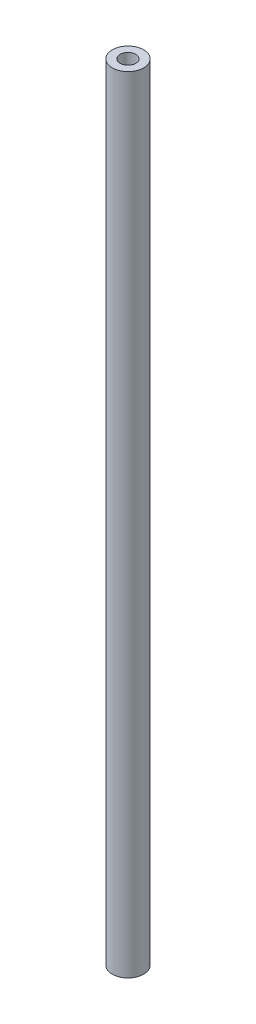
ISO-10303-21;
HEADER;
FILE_DESCRIPTION(('STEP AP214'),'2;1');
FILE_NAME('part.step','',(''),(''),'','','');
FILE_SCHEMA(('AUTOMOTIVE_DESIGN { 1 0 10303 214 1 1 1 1 }'));
ENDSEC;
DATA;
#1=APPLICATION_CONTEXT('core data for automotive mechanical design processes');
#2=APPLICATION_PROTOCOL_DEFINITION('international standard','automotive_design',2000,#1);
#3=PRODUCT_CONTEXT('',#1,'mechanical');
#4=PRODUCT('Part','Part','',(#3));
#5=PRODUCT_RELATED_PRODUCT_CATEGORY('part','',(#4));
#6=PRODUCT_DEFINITION_FORMATION('','',#4);
#7=PRODUCT_DEFINITION_CONTEXT('part definition',#1,'design');
#8=PRODUCT_DEFINITION('design','',#6,#7);
#9=PRODUCT_DEFINITION_SHAPE('','',#8);
#10=(LENGTH_UNIT() NAMED_UNIT(*) SI_UNIT(.MILLI.,.METRE.));
#11=(NAMED_UNIT(*) PLANE_ANGLE_UNIT() SI_UNIT($,.RADIAN.));
#12=(NAMED_UNIT(*) SI_UNIT($,.STERADIAN.) SOLID_ANGLE_UNIT());
#13=UNCERTAINTY_MEASURE_WITH_UNIT(LENGTH_MEASURE(1.E-05),#10,'distance_accuracy_value','');
#14=(GEOMETRIC_REPRESENTATION_CONTEXT(3) GLOBAL_UNCERTAINTY_ASSIGNED_CONTEXT((#13)) GLOBAL_UNIT_ASSIGNED_CONTEXT((#10,
#11,#12)) REPRESENTATION_CONTEXT('',''));
#15=CARTESIAN_POINT('',(0.,0.,0.));
#16=DIRECTION('',(0.,0.,1.));
#17=DIRECTION('',(1.,0.,0.));
#18=AXIS2_PLACEMENT_3D('',#15,#16,#17);
#19=CARTESIAN_POINT('',(0.,100.,0.));
#20=DIRECTION('',(0.,1.,0.));
#21=DIRECTION('',(0.,0.,1.));
#22=AXIS2_PLACEMENT_3D('',#19,#20,#21);
#23=PLANE('',#22);
#24=CARTESIAN_POINT('',(0.,100.,0.));
#25=DIRECTION('',(0.,1.,0.));
#26=DIRECTION('',(0.,0.,1.));
#27=AXIS2_PLACEMENT_3D('',#24,#25,#26);
#28=CIRCLE('',#27,2.);
#29=CARTESIAN_POINT('',(0.,100.,2.));
#30=VERTEX_POINT('',#29);
#31=EDGE_CURVE('E10',#30,#30,#28,.T.);
#32=ORIENTED_EDGE('',*,*,#31,.T.);
#33=EDGE_LOOP('',(#32));
#34=FACE_BOUND('',#33,.T.);
#35=CARTESIAN_POINT('',(0.,100.,0.));
#36=DIRECTION('',(0.,1.,0.));
#37=DIRECTION('',(0.,0.,1.));
#38=AXIS2_PLACEMENT_3D('',#35,#36,#37);
#39=CIRCLE('',#38,1.);
#40=CARTESIAN_POINT('',(0.,100.,1.));
#41=VERTEX_POINT('',#40);
#42=EDGE_CURVE('E44',#41,#41,#39,.T.);
#43=ORIENTED_EDGE('',*,*,#42,.F.);
#44=EDGE_LOOP('',(#43));
#45=FACE_BOUND('',#44,.T.);
#46=ADVANCED_FACE('F33',(#34,#45),#23,.T.);
#47=CARTESIAN_POINT('',(0.,0.,0.));
#48=DIRECTION('',(0.,1.,0.));
#49=DIRECTION('',(0.,0.,1.));
#50=AXIS2_PLACEMENT_3D('',#47,#48,#49);
#51=PLANE('',#50);
#52=CARTESIAN_POINT('',(0.,0.,0.));
#53=DIRECTION('',(0.,1.,0.));
#54=DIRECTION('',(0.,0.,1.));
#55=AXIS2_PLACEMENT_3D('',#52,#53,#54);
#56=CIRCLE('',#55,2.);
#57=CARTESIAN_POINT('',(0.,0.,2.));
#58=VERTEX_POINT('',#57);
#59=EDGE_CURVE('E37',#58,#58,#56,.T.);
#60=ORIENTED_EDGE('',*,*,#59,.F.);
#61=EDGE_LOOP('',(#60));
#62=FACE_BOUND('',#61,.T.);
#63=CARTESIAN_POINT('',(0.,0.,0.));
#64=DIRECTION('',(0.,1.,0.));
#65=DIRECTION('',(0.,0.,1.));
#66=AXIS2_PLACEMENT_3D('',#63,#64,#65);
#67=CIRCLE('',#66,1.);
#68=CARTESIAN_POINT('',(0.,0.,1.));
#69=VERTEX_POINT('',#68);
#70=EDGE_CURVE('E46',#69,#69,#67,.T.);
#71=ORIENTED_EDGE('',*,*,#70,.T.);
#72=EDGE_LOOP('',(#71));
#73=FACE_BOUND('',#72,.T.);
#74=ADVANCED_FACE('F56',(#62,#73),#51,.F.);
#75=CARTESIAN_POINT('',(0.,100.,0.));
#76=DIRECTION('',(0.,-1.,0.));
#77=DIRECTION('',(0.,0.,-1.));
#78=AXIS2_PLACEMENT_3D('',#75,#76,#77);
#79=CYLINDRICAL_SURFACE('',#78,2.);
#80=ORIENTED_EDGE('',*,*,#31,.F.);
#81=EDGE_LOOP('',(#80));
#82=FACE_BOUND('',#81,.T.);
#83=ORIENTED_EDGE('',*,*,#59,.T.);
#84=EDGE_LOOP('',(#83));
#85=FACE_BOUND('',#84,.T.);
#86=ADVANCED_FACE('F35',(#82,#85),#79,.T.);
#87=CARTESIAN_POINT('',(0.,100.,0.));
#88=DIRECTION('',(0.,-1.,0.));
#89=DIRECTION('',(0.,0.,-1.));
#90=AXIS2_PLACEMENT_3D('',#87,#88,#89);
#91=CYLINDRICAL_SURFACE('',#90,1.);
#92=ORIENTED_EDGE('',*,*,#42,.T.);
#93=EDGE_LOOP('',(#92));
#94=FACE_BOUND('',#93,.T.);
#95=ORIENTED_EDGE('',*,*,#70,.F.);
#96=EDGE_LOOP('',(#95));
#97=FACE_BOUND('',#96,.T.);
#98=ADVANCED_FACE('F52',(#94,#97),#91,.F.);
#99=CLOSED_SHELL('',(#46,#74,#86,#98));
#100=MANIFOLD_SOLID_BREP('B2',#99);
#101=ADVANCED_BREP_SHAPE_REPRESENTATION('',(#18,#100),#14);
#102=SHAPE_DEFINITION_REPRESENTATION(#9,#101);
ENDSEC;
END-ISO-10303-21;
